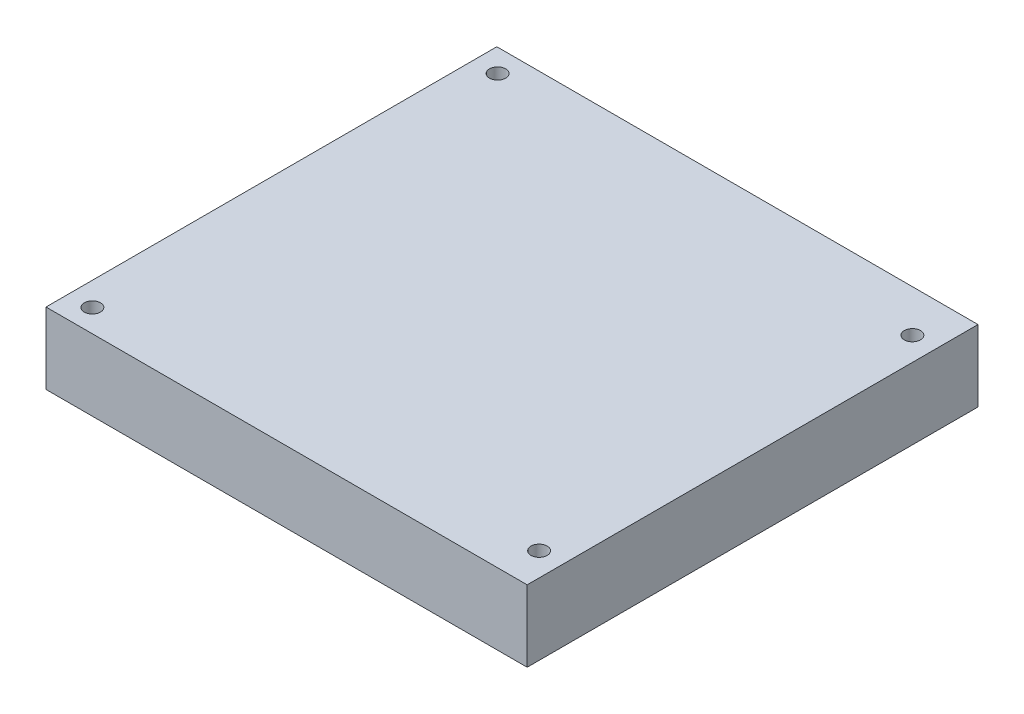
ISO-10303-21;
HEADER;
FILE_DESCRIPTION(('STEP AP214'),'2;1');
FILE_NAME('part.step','',(''),(''),'','','');
FILE_SCHEMA(('AUTOMOTIVE_DESIGN { 1 0 10303 214 1 1 1 1 }'));
ENDSEC;
DATA;
#1=APPLICATION_CONTEXT('core data for automotive mechanical design processes');
#2=APPLICATION_PROTOCOL_DEFINITION('international standard','automotive_design',2000,#1);
#3=PRODUCT_CONTEXT('',#1,'mechanical');
#4=PRODUCT('Part','Part','',(#3));
#5=PRODUCT_RELATED_PRODUCT_CATEGORY('part','',(#4));
#6=PRODUCT_DEFINITION_FORMATION('','',#4);
#7=PRODUCT_DEFINITION_CONTEXT('part definition',#1,'design');
#8=PRODUCT_DEFINITION('design','',#6,#7);
#9=PRODUCT_DEFINITION_SHAPE('','',#8);
#10=(LENGTH_UNIT() NAMED_UNIT(*) SI_UNIT(.MILLI.,.METRE.));
#11=(NAMED_UNIT(*) PLANE_ANGLE_UNIT() SI_UNIT($,.RADIAN.));
#12=(NAMED_UNIT(*) SI_UNIT($,.STERADIAN.) SOLID_ANGLE_UNIT());
#13=UNCERTAINTY_MEASURE_WITH_UNIT(LENGTH_MEASURE(1.E-05),#10,'distance_accuracy_value','');
#14=(GEOMETRIC_REPRESENTATION_CONTEXT(3) GLOBAL_UNCERTAINTY_ASSIGNED_CONTEXT((#13)) GLOBAL_UNIT_ASSIGNED_CONTEXT((#10,
#11,#12)) REPRESENTATION_CONTEXT('',''));
#15=CARTESIAN_POINT('',(0.,0.,0.));
#16=DIRECTION('',(0.,0.,1.));
#17=DIRECTION('',(1.,0.,0.));
#18=AXIS2_PLACEMENT_3D('',#15,#16,#17);
#19=CARTESIAN_POINT('',(0.,14.1,0.));
#20=DIRECTION('',(0.,-1.,0.));
#21=DIRECTION('',(0.,0.,-1.));
#22=AXIS2_PLACEMENT_3D('',#19,#20,#21);
#23=PLANE('',#22);
#24=DIRECTION('',(0.,0.,-1.));
#25=VECTOR('',#24,1.);
#26=CARTESIAN_POINT('',(47.5,14.1,44.505));
#27=LINE('',#26,#25);
#28=CARTESIAN_POINT('',(47.5,14.1,44.505));
#29=VERTEX_POINT('',#28);
#30=CARTESIAN_POINT('',(47.5,14.1,-44.505));
#31=VERTEX_POINT('',#30);
#32=EDGE_CURVE('E92',#29,#31,#27,.T.);
#33=ORIENTED_EDGE('',*,*,#32,.T.);
#34=DIRECTION('',(-1.,0.,0.));
#35=VECTOR('',#34,1.);
#36=CARTESIAN_POINT('',(-47.5,14.1,-44.505));
#37=LINE('',#36,#35);
#38=CARTESIAN_POINT('',(-47.5,14.1,-44.505));
#39=VERTEX_POINT('',#38);
#40=EDGE_CURVE('E87',#31,#39,#37,.T.);
#41=ORIENTED_EDGE('',*,*,#40,.T.);
#42=DIRECTION('',(0.,0.,1.));
#43=VECTOR('',#42,1.);
#44=CARTESIAN_POINT('',(-47.5,14.1,44.505));
#45=LINE('',#44,#43);
#46=CARTESIAN_POINT('',(-47.5,14.1,44.505));
#47=VERTEX_POINT('',#46);
#48=EDGE_CURVE('E90',#39,#47,#45,.T.);
#49=ORIENTED_EDGE('',*,*,#48,.T.);
#50=DIRECTION('',(1.,0.,0.));
#51=VECTOR('',#50,1.);
#52=CARTESIAN_POINT('',(-47.5,14.1,44.505));
#53=LINE('',#52,#51);
#54=EDGE_CURVE('E57',#47,#29,#53,.T.);
#55=ORIENTED_EDGE('',*,*,#54,.T.);
#56=EDGE_LOOP('',(#33,#41,#49,#55));
#57=FACE_BOUND('',#56,.T.);
#58=CARTESIAN_POINT('',(-42.85,14.1,-40.));
#59=DIRECTION('',(0.,1.,0.));
#60=DIRECTION('',(0.,0.,1.));
#61=AXIS2_PLACEMENT_3D('',#58,#59,#60);
#62=CIRCLE('',#61,1.6);
#63=CARTESIAN_POINT('',(-42.85,14.1,-38.4));
#64=VERTEX_POINT('',#63);
#65=EDGE_CURVE('E107',#64,#64,#62,.T.);
#66=ORIENTED_EDGE('',*,*,#65,.F.);
#67=EDGE_LOOP('',(#66));
#68=FACE_BOUND('',#67,.T.);
#69=CARTESIAN_POINT('',(42.85,14.1,-36.2));
#70=DIRECTION('',(0.,1.,0.));
#71=DIRECTION('',(0.,0.,1.));
#72=AXIS2_PLACEMENT_3D('',#69,#70,#71);
#73=CIRCLE('',#72,1.6);
#74=CARTESIAN_POINT('',(42.85,14.1,-34.6));
#75=VERTEX_POINT('',#74);
#76=EDGE_CURVE('E122',#75,#75,#73,.T.);
#77=ORIENTED_EDGE('',*,*,#76,.F.);
#78=EDGE_LOOP('',(#77));
#79=FACE_BOUND('',#78,.T.);
#80=CARTESIAN_POINT('',(-42.85,14.1,40.));
#81=DIRECTION('',(0.,1.,0.));
#82=DIRECTION('',(0.,0.,1.));
#83=AXIS2_PLACEMENT_3D('',#80,#81,#82);
#84=CIRCLE('',#83,1.6);
#85=CARTESIAN_POINT('',(-42.85,14.1,41.6));
#86=VERTEX_POINT('',#85);
#87=EDGE_CURVE('E128',#86,#86,#84,.T.);
#88=ORIENTED_EDGE('',*,*,#87,.F.);
#89=EDGE_LOOP('',(#88));
#90=FACE_BOUND('',#89,.T.);
#91=CARTESIAN_POINT('',(42.85,14.1,37.5));
#92=DIRECTION('',(0.,1.,0.));
#93=DIRECTION('',(0.,0.,1.));
#94=AXIS2_PLACEMENT_3D('',#91,#92,#93);
#95=CIRCLE('',#94,1.6);
#96=CARTESIAN_POINT('',(42.85,14.1,39.1));
#97=VERTEX_POINT('',#96);
#98=EDGE_CURVE('E134',#97,#97,#95,.T.);
#99=ORIENTED_EDGE('',*,*,#98,.F.);
#100=EDGE_LOOP('',(#99));
#101=FACE_BOUND('',#100,.T.);
#102=ADVANCED_FACE('F40',(#57,#68,#79,#90,#101),#23,.F.);
#103=CARTESIAN_POINT('',(0.,0.,0.));
#104=DIRECTION('',(0.,-1.,0.));
#105=DIRECTION('',(0.,0.,-1.));
#106=AXIS2_PLACEMENT_3D('',#103,#104,#105);
#107=PLANE('',#106);
#108=CARTESIAN_POINT('',(-42.85,0.,40.));
#109=DIRECTION('',(0.,1.,0.));
#110=DIRECTION('',(0.,0.,1.));
#111=AXIS2_PLACEMENT_3D('',#108,#109,#110);
#112=CIRCLE('',#111,1.6);
#113=CARTESIAN_POINT('',(-42.85,0.,41.6));
#114=VERTEX_POINT('',#113);
#115=EDGE_CURVE('E131',#114,#114,#112,.T.);
#116=ORIENTED_EDGE('',*,*,#115,.T.);
#117=EDGE_LOOP('',(#116));
#118=FACE_BOUND('',#117,.T.);
#119=CARTESIAN_POINT('',(-42.85,0.,-40.));
#120=DIRECTION('',(0.,1.,0.));
#121=DIRECTION('',(0.,0.,1.));
#122=AXIS2_PLACEMENT_3D('',#119,#120,#121);
#123=CIRCLE('',#122,1.6);
#124=CARTESIAN_POINT('',(-42.85,0.,-38.4));
#125=VERTEX_POINT('',#124);
#126=EDGE_CURVE('E119',#125,#125,#123,.T.);
#127=ORIENTED_EDGE('',*,*,#126,.T.);
#128=EDGE_LOOP('',(#127));
#129=FACE_BOUND('',#128,.T.);
#130=DIRECTION('',(0.,0.,-1.));
#131=VECTOR('',#130,1.);
#132=CARTESIAN_POINT('',(47.5,0.,44.505));
#133=LINE('',#132,#131);
#134=CARTESIAN_POINT('',(47.5,0.,44.505));
#135=VERTEX_POINT('',#134);
#136=CARTESIAN_POINT('',(47.5,0.,-44.505));
#137=VERTEX_POINT('',#136);
#138=EDGE_CURVE('E104',#135,#137,#133,.T.);
#139=ORIENTED_EDGE('',*,*,#138,.F.);
#140=DIRECTION('',(1.,0.,0.));
#141=VECTOR('',#140,1.);
#142=CARTESIAN_POINT('',(-47.5,0.,44.505));
#143=LINE('',#142,#141);
#144=CARTESIAN_POINT('',(-47.5,0.,44.505));
#145=VERTEX_POINT('',#144);
#146=EDGE_CURVE('E80',#145,#135,#143,.T.);
#147=ORIENTED_EDGE('',*,*,#146,.F.);
#148=DIRECTION('',(0.,0.,1.));
#149=VECTOR('',#148,1.);
#150=CARTESIAN_POINT('',(-47.5,0.,44.505));
#151=LINE('',#150,#149);
#152=CARTESIAN_POINT('',(-47.5,0.,-44.505));
#153=VERTEX_POINT('',#152);
#154=EDGE_CURVE('E74',#153,#145,#151,.T.);
#155=ORIENTED_EDGE('',*,*,#154,.F.);
#156=DIRECTION('',(-1.,0.,0.));
#157=VECTOR('',#156,1.);
#158=CARTESIAN_POINT('',(-47.5,0.,-44.505));
#159=LINE('',#158,#157);
#160=EDGE_CURVE('E96',#137,#153,#159,.T.);
#161=ORIENTED_EDGE('',*,*,#160,.F.);
#162=EDGE_LOOP('',(#139,#147,#155,#161));
#163=FACE_BOUND('',#162,.T.);
#164=CARTESIAN_POINT('',(42.85,0.,-36.2));
#165=DIRECTION('',(0.,1.,0.));
#166=DIRECTION('',(0.,0.,1.));
#167=AXIS2_PLACEMENT_3D('',#164,#165,#166);
#168=CIRCLE('',#167,1.6);
#169=CARTESIAN_POINT('',(42.85,0.,-34.6));
#170=VERTEX_POINT('',#169);
#171=EDGE_CURVE('E125',#170,#170,#168,.T.);
#172=ORIENTED_EDGE('',*,*,#171,.T.);
#173=EDGE_LOOP('',(#172));
#174=FACE_BOUND('',#173,.T.);
#175=CARTESIAN_POINT('',(42.85,0.,37.5));
#176=DIRECTION('',(0.,1.,0.));
#177=DIRECTION('',(0.,0.,1.));
#178=AXIS2_PLACEMENT_3D('',#175,#176,#177);
#179=CIRCLE('',#178,1.6);
#180=CARTESIAN_POINT('',(42.85,0.,39.1));
#181=VERTEX_POINT('',#180);
#182=EDGE_CURVE('E137',#181,#181,#179,.T.);
#183=ORIENTED_EDGE('',*,*,#182,.T.);
#184=EDGE_LOOP('',(#183));
#185=FACE_BOUND('',#184,.T.);
#186=ADVANCED_FACE('F115',(#118,#129,#163,#174,#185),#107,.T.);
#187=CARTESIAN_POINT('',(47.5,14.1,44.505));
#188=DIRECTION('',(-1.,0.,0.));
#189=DIRECTION('',(0.,0.,1.));
#190=AXIS2_PLACEMENT_3D('',#187,#188,#189);
#191=PLANE('',#190);
#192=ORIENTED_EDGE('',*,*,#138,.T.);
#193=DIRECTION('',(0.,-1.,0.));
#194=VECTOR('',#193,1.);
#195=CARTESIAN_POINT('',(47.5,14.1,-44.505));
#196=LINE('',#195,#194);
#197=EDGE_CURVE('E11',#31,#137,#196,.T.);
#198=ORIENTED_EDGE('',*,*,#197,.F.);
#199=ORIENTED_EDGE('',*,*,#32,.F.);
#200=DIRECTION('',(0.,-1.,0.));
#201=VECTOR('',#200,1.);
#202=CARTESIAN_POINT('',(47.5,14.1,44.505));
#203=LINE('',#202,#201);
#204=EDGE_CURVE('E100',#29,#135,#203,.T.);
#205=ORIENTED_EDGE('',*,*,#204,.T.);
#206=EDGE_LOOP('',(#192,#198,#199,#205));
#207=FACE_BOUND('',#206,.T.);
#208=ADVANCED_FACE('F42',(#207),#191,.F.);
#209=CARTESIAN_POINT('',(-47.5,14.1,-44.505));
#210=DIRECTION('',(0.,0.,1.));
#211=DIRECTION('',(1.,0.,0.));
#212=AXIS2_PLACEMENT_3D('',#209,#210,#211);
#213=PLANE('',#212);
#214=ORIENTED_EDGE('',*,*,#160,.T.);
#215=DIRECTION('',(0.,-1.,0.));
#216=VECTOR('',#215,1.);
#217=CARTESIAN_POINT('',(-47.5,14.1,-44.505));
#218=LINE('',#217,#216);
#219=EDGE_CURVE('E49',#39,#153,#218,.T.);
#220=ORIENTED_EDGE('',*,*,#219,.F.);
#221=ORIENTED_EDGE('',*,*,#40,.F.);
#222=ORIENTED_EDGE('',*,*,#197,.T.);
#223=EDGE_LOOP('',(#214,#220,#221,#222));
#224=FACE_BOUND('',#223,.T.);
#225=ADVANCED_FACE('F95',(#224),#213,.F.);
#226=CARTESIAN_POINT('',(-47.5,14.1,44.505));
#227=DIRECTION('',(1.,0.,0.));
#228=DIRECTION('',(0.,0.,-1.));
#229=AXIS2_PLACEMENT_3D('',#226,#227,#228);
#230=PLANE('',#229);
#231=ORIENTED_EDGE('',*,*,#154,.T.);
#232=DIRECTION('',(0.,-1.,0.));
#233=VECTOR('',#232,1.);
#234=CARTESIAN_POINT('',(-47.5,14.1,44.505));
#235=LINE('',#234,#233);
#236=EDGE_CURVE('E97',#47,#145,#235,.T.);
#237=ORIENTED_EDGE('',*,*,#236,.F.);
#238=ORIENTED_EDGE('',*,*,#48,.F.);
#239=ORIENTED_EDGE('',*,*,#219,.T.);
#240=EDGE_LOOP('',(#231,#237,#238,#239));
#241=FACE_BOUND('',#240,.T.);
#242=ADVANCED_FACE('F98',(#241),#230,.F.);
#243=CARTESIAN_POINT('',(-47.5,14.1,44.505));
#244=DIRECTION('',(0.,0.,-1.));
#245=DIRECTION('',(-1.,0.,0.));
#246=AXIS2_PLACEMENT_3D('',#243,#244,#245);
#247=PLANE('',#246);
#248=ORIENTED_EDGE('',*,*,#146,.T.);
#249=ORIENTED_EDGE('',*,*,#204,.F.);
#250=ORIENTED_EDGE('',*,*,#54,.F.);
#251=ORIENTED_EDGE('',*,*,#236,.T.);
#252=EDGE_LOOP('',(#248,#249,#250,#251));
#253=FACE_BOUND('',#252,.T.);
#254=ADVANCED_FACE('F112',(#253),#247,.F.);
#255=CARTESIAN_POINT('',(-42.85,14.1,-40.));
#256=DIRECTION('',(0.,-1.,0.));
#257=DIRECTION('',(0.,0.,-1.));
#258=AXIS2_PLACEMENT_3D('',#255,#256,#257);
#259=CYLINDRICAL_SURFACE('',#258,1.6);
#260=ORIENTED_EDGE('',*,*,#65,.T.);
#261=EDGE_LOOP('',(#260));
#262=FACE_BOUND('',#261,.T.);
#263=ORIENTED_EDGE('',*,*,#126,.F.);
#264=EDGE_LOOP('',(#263));
#265=FACE_BOUND('',#264,.T.);
#266=ADVANCED_FACE('F153',(#262,#265),#259,.F.);
#267=CARTESIAN_POINT('',(42.85,14.1,-36.2));
#268=DIRECTION('',(0.,-1.,0.));
#269=DIRECTION('',(0.,0.,-1.));
#270=AXIS2_PLACEMENT_3D('',#267,#268,#269);
#271=CYLINDRICAL_SURFACE('',#270,1.6);
#272=ORIENTED_EDGE('',*,*,#76,.T.);
#273=EDGE_LOOP('',(#272));
#274=FACE_BOUND('',#273,.T.);
#275=ORIENTED_EDGE('',*,*,#171,.F.);
#276=EDGE_LOOP('',(#275));
#277=FACE_BOUND('',#276,.T.);
#278=ADVANCED_FACE('F201',(#274,#277),#271,.F.);
#279=CARTESIAN_POINT('',(-42.85,14.1,40.));
#280=DIRECTION('',(0.,-1.,0.));
#281=DIRECTION('',(0.,0.,-1.));
#282=AXIS2_PLACEMENT_3D('',#279,#280,#281);
#283=CYLINDRICAL_SURFACE('',#282,1.6);
#284=ORIENTED_EDGE('',*,*,#87,.T.);
#285=EDGE_LOOP('',(#284));
#286=FACE_BOUND('',#285,.T.);
#287=ORIENTED_EDGE('',*,*,#115,.F.);
#288=EDGE_LOOP('',(#287));
#289=FACE_BOUND('',#288,.T.);
#290=ADVANCED_FACE('F209',(#286,#289),#283,.F.);
#291=CARTESIAN_POINT('',(42.85,14.1,37.5));
#292=DIRECTION('',(0.,-1.,0.));
#293=DIRECTION('',(0.,0.,-1.));
#294=AXIS2_PLACEMENT_3D('',#291,#292,#293);
#295=CYLINDRICAL_SURFACE('',#294,1.6);
#296=ORIENTED_EDGE('',*,*,#98,.T.);
#297=EDGE_LOOP('',(#296));
#298=FACE_BOUND('',#297,.T.);
#299=ORIENTED_EDGE('',*,*,#182,.F.);
#300=EDGE_LOOP('',(#299));
#301=FACE_BOUND('',#300,.T.);
#302=ADVANCED_FACE('F143',(#298,#301),#295,.F.);
#303=CLOSED_SHELL('',(#102,#186,#208,#225,#242,#254,#266,#278,#290,#302));
#304=MANIFOLD_SOLID_BREP('B2',#303);
#305=ADVANCED_BREP_SHAPE_REPRESENTATION('',(#18,#304),#14);
#306=SHAPE_DEFINITION_REPRESENTATION(#9,#305);
ENDSEC;
END-ISO-10303-21;
